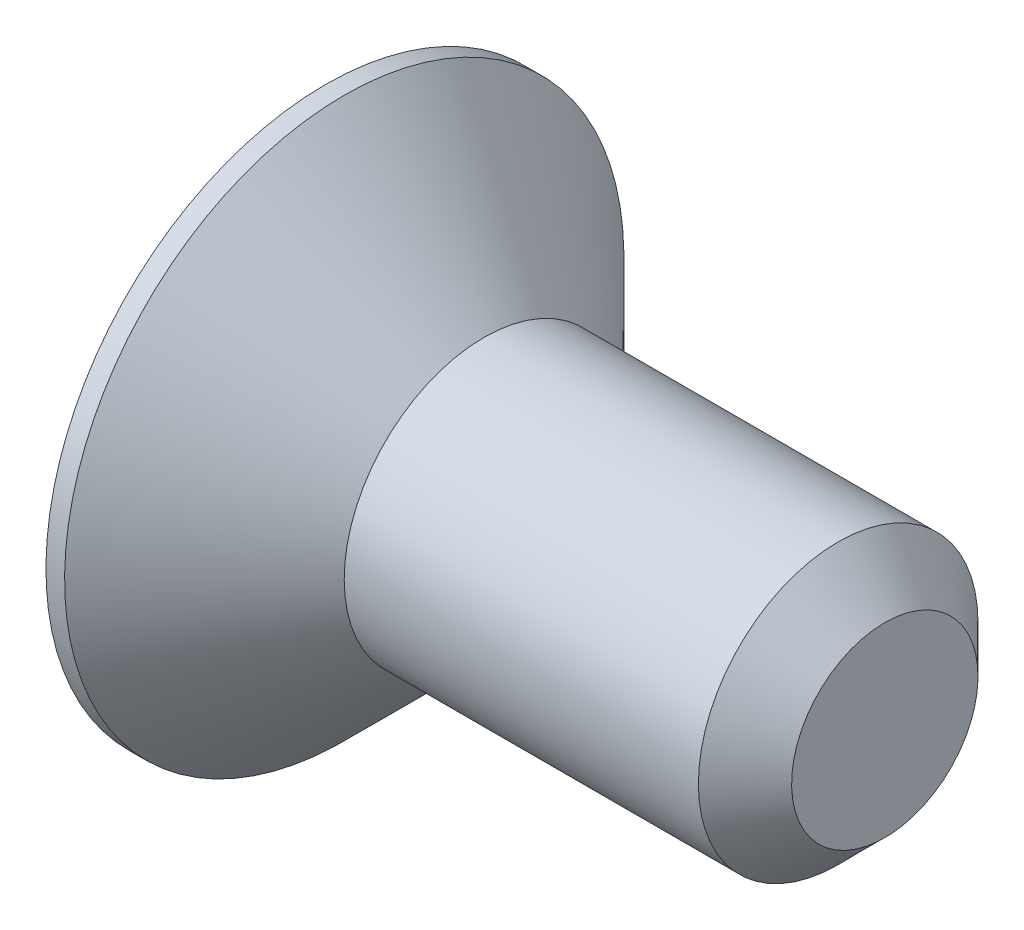
ISO-10303-21;
HEADER;
FILE_DESCRIPTION(('STEP AP214'),'2;1');
FILE_NAME('part.step','',(''),(''),'','','');
FILE_SCHEMA(('AUTOMOTIVE_DESIGN { 1 0 10303 214 1 1 1 1 }'));
ENDSEC;
DATA;
#1=APPLICATION_CONTEXT('core data for automotive mechanical design processes');
#2=APPLICATION_PROTOCOL_DEFINITION('international standard','automotive_design',2000,#1);
#3=PRODUCT_CONTEXT('',#1,'mechanical');
#4=PRODUCT('Part','Part','',(#3));
#5=PRODUCT_RELATED_PRODUCT_CATEGORY('part','',(#4));
#6=PRODUCT_DEFINITION_FORMATION('','',#4);
#7=PRODUCT_DEFINITION_CONTEXT('part definition',#1,'design');
#8=PRODUCT_DEFINITION('design','',#6,#7);
#9=PRODUCT_DEFINITION_SHAPE('','',#8);
#10=(LENGTH_UNIT() NAMED_UNIT(*) SI_UNIT(.MILLI.,.METRE.));
#11=(NAMED_UNIT(*) PLANE_ANGLE_UNIT() SI_UNIT($,.RADIAN.));
#12=(NAMED_UNIT(*) SI_UNIT($,.STERADIAN.) SOLID_ANGLE_UNIT());
#13=UNCERTAINTY_MEASURE_WITH_UNIT(LENGTH_MEASURE(1.E-05),#10,'distance_accuracy_value','');
#14=(GEOMETRIC_REPRESENTATION_CONTEXT(3) GLOBAL_UNCERTAINTY_ASSIGNED_CONTEXT((#13)) GLOBAL_UNIT_ASSIGNED_CONTEXT((#10,
#11,#12)) REPRESENTATION_CONTEXT('',''));
#15=CARTESIAN_POINT('',(0.,0.,0.));
#16=DIRECTION('',(0.,0.,1.));
#17=DIRECTION('',(1.,0.,0.));
#18=AXIS2_PLACEMENT_3D('',#15,#16,#17);
#19=CARTESIAN_POINT('',(0.,0.,0.));
#20=DIRECTION('',(-1.,0.,0.));
#21=DIRECTION('',(0.,-1.,0.));
#22=AXIS2_PLACEMENT_3D('',#19,#20,#21);
#23=PLANE('',#22);
#24=DIRECTION('',(0.,0.5,-0.866025403784438));
#25=VECTOR('',#24,1.);
#26=CARTESIAN_POINT('',(0.,0.577350269189626,1.));
#27=LINE('',#26,#25);
#28=CARTESIAN_POINT('',(0.,0.577350269189626,1.));
#29=VERTEX_POINT('',#28);
#30=CARTESIAN_POINT('',(0.,1.15470053837925,0.));
#31=VERTEX_POINT('',#30);
#32=EDGE_CURVE('E48',#29,#31,#27,.T.);
#33=ORIENTED_EDGE('',*,*,#32,.F.);
#34=DIRECTION('',(0.,1.,0.));
#35=VECTOR('',#34,1.);
#36=CARTESIAN_POINT('',(0.,-0.577350269189626,1.));
#37=LINE('',#36,#35);
#38=CARTESIAN_POINT('',(0.,-0.577350269189626,1.));
#39=VERTEX_POINT('',#38);
#40=EDGE_CURVE('E131',#39,#29,#37,.T.);
#41=ORIENTED_EDGE('',*,*,#40,.F.);
#42=DIRECTION('',(0.,0.5,0.866025403784439));
#43=VECTOR('',#42,1.);
#44=CARTESIAN_POINT('',(0.,-1.15470053837925,0.));
#45=LINE('',#44,#43);
#46=CARTESIAN_POINT('',(0.,-1.15470053837925,0.));
#47=VERTEX_POINT('',#46);
#48=EDGE_CURVE('E129',#47,#39,#45,.T.);
#49=ORIENTED_EDGE('',*,*,#48,.F.);
#50=DIRECTION('',(0.,-0.5,0.866025403784439));
#51=VECTOR('',#50,1.);
#52=CARTESIAN_POINT('',(0.,-0.577350269189625,-1.));
#53=LINE('',#52,#51);
#54=CARTESIAN_POINT('',(0.,-0.577350269189625,-1.));
#55=VERTEX_POINT('',#54);
#56=EDGE_CURVE('E96',#55,#47,#53,.T.);
#57=ORIENTED_EDGE('',*,*,#56,.F.);
#58=DIRECTION('',(0.,-1.,0.));
#59=VECTOR('',#58,1.);
#60=CARTESIAN_POINT('',(0.,0.577350269189626,-1.));
#61=LINE('',#60,#59);
#62=CARTESIAN_POINT('',(0.,0.577350269189626,-1.));
#63=VERTEX_POINT('',#62);
#64=EDGE_CURVE('E125',#63,#55,#61,.T.);
#65=ORIENTED_EDGE('',*,*,#64,.F.);
#66=DIRECTION('',(0.,-0.5,-0.866025403784439));
#67=VECTOR('',#66,1.);
#68=CARTESIAN_POINT('',(0.,1.15470053837925,0.));
#69=LINE('',#68,#67);
#70=EDGE_CURVE('E122',#31,#63,#69,.T.);
#71=ORIENTED_EDGE('',*,*,#70,.F.);
#72=EDGE_LOOP('',(#33,#41,#49,#57,#65,#71));
#73=FACE_BOUND('',#72,.T.);
#74=CARTESIAN_POINT('',(0.,0.,0.));
#75=DIRECTION('',(1.,0.,0.));
#76=DIRECTION('',(0.,1.,0.));
#77=AXIS2_PLACEMENT_3D('',#74,#75,#76);
#78=CIRCLE('',#77,3.);
#79=CARTESIAN_POINT('',(0.,3.,0.));
#80=VERTEX_POINT('',#79);
#81=EDGE_CURVE('E146',#80,#80,#78,.T.);
#82=ORIENTED_EDGE('',*,*,#81,.F.);
#83=EDGE_LOOP('',(#82));
#84=FACE_BOUND('',#83,.T.);
#85=ADVANCED_FACE('F33',(#73,#84),#23,.T.);
#86=CARTESIAN_POINT('',(6.,0.,0.));
#87=DIRECTION('',(1.,0.,0.));
#88=DIRECTION('',(0.,1.,0.));
#89=AXIS2_PLACEMENT_3D('',#86,#87,#88);
#90=CYLINDRICAL_SURFACE('',#89,3.);
#91=ORIENTED_EDGE('',*,*,#81,.T.);
#92=EDGE_LOOP('',(#91));
#93=FACE_BOUND('',#92,.T.);
#94=CARTESIAN_POINT('',(0.199999999999964,0.,0.));
#95=DIRECTION('',(1.,0.,0.));
#96=DIRECTION('',(0.,1.,0.));
#97=AXIS2_PLACEMENT_3D('',#94,#95,#96);
#98=CIRCLE('',#97,3.);
#99=CARTESIAN_POINT('',(0.199999999999964,3.,0.));
#100=VERTEX_POINT('',#99);
#101=EDGE_CURVE('E143',#100,#100,#98,.T.);
#102=ORIENTED_EDGE('',*,*,#101,.F.);
#103=EDGE_LOOP('',(#102));
#104=FACE_BOUND('',#103,.T.);
#105=ADVANCED_FACE('F166',(#93,#104),#90,.T.);
#106=CARTESIAN_POINT('',(1.7,0.,0.));
#107=DIRECTION('',(-1.,0.,0.));
#108=DIRECTION('',(0.,-1.,0.));
#109=AXIS2_PLACEMENT_3D('',#106,#107,#108);
#110=CONICAL_SURFACE('',#109,1.5,0.785398163397437);
#111=ORIENTED_EDGE('',*,*,#101,.T.);
#112=EDGE_LOOP('',(#111));
#113=FACE_BOUND('',#112,.T.);
#114=CARTESIAN_POINT('',(1.7,0.,0.));
#115=DIRECTION('',(1.,0.,0.));
#116=DIRECTION('',(0.,1.,0.));
#117=AXIS2_PLACEMENT_3D('',#114,#115,#116);
#118=CIRCLE('',#117,1.5);
#119=CARTESIAN_POINT('',(1.7,1.5,0.));
#120=VERTEX_POINT('',#119);
#121=EDGE_CURVE('E135',#120,#120,#118,.T.);
#122=ORIENTED_EDGE('',*,*,#121,.F.);
#123=EDGE_LOOP('',(#122));
#124=FACE_BOUND('',#123,.T.);
#125=ADVANCED_FACE('F171',(#113,#124),#110,.T.);
#126=CARTESIAN_POINT('',(6.,0.,0.));
#127=DIRECTION('',(1.,0.,0.));
#128=DIRECTION('',(0.,1.,0.));
#129=AXIS2_PLACEMENT_3D('',#126,#127,#128);
#130=CYLINDRICAL_SURFACE('',#129,1.5);
#131=CARTESIAN_POINT('',(5.5,0.,0.));
#132=DIRECTION('',(1.,0.,0.));
#133=DIRECTION('',(0.,1.,0.));
#134=AXIS2_PLACEMENT_3D('',#131,#132,#133);
#135=CIRCLE('',#134,1.5);
#136=CARTESIAN_POINT('',(5.5,1.5,0.));
#137=VERTEX_POINT('',#136);
#138=EDGE_CURVE('E11',#137,#137,#135,.F.);
#139=ORIENTED_EDGE('',*,*,#138,.T.);
#140=EDGE_LOOP('',(#139));
#141=FACE_BOUND('',#140,.T.);
#142=ORIENTED_EDGE('',*,*,#121,.T.);
#143=EDGE_LOOP('',(#142));
#144=FACE_BOUND('',#143,.T.);
#145=ADVANCED_FACE('F162',(#141,#144),#130,.T.);
#146=CARTESIAN_POINT('',(6.,1.5,0.));
#147=DIRECTION('',(1.,0.,0.));
#148=DIRECTION('',(0.,1.,0.));
#149=AXIS2_PLACEMENT_3D('',#146,#147,#148);
#150=PLANE('',#149);
#151=CARTESIAN_POINT('',(6.,0.,0.));
#152=DIRECTION('',(1.,0.,0.));
#153=DIRECTION('',(0.,1.,0.));
#154=AXIS2_PLACEMENT_3D('',#151,#152,#153);
#155=CIRCLE('',#154,0.999999999999997);
#156=CARTESIAN_POINT('',(6.,0.999999999999998,0.));
#157=VERTEX_POINT('',#156);
#158=EDGE_CURVE('E41',#157,#157,#155,.T.);
#159=ORIENTED_EDGE('',*,*,#158,.T.);
#160=EDGE_LOOP('',(#159));
#161=FACE_BOUND('',#160,.T.);
#162=ADVANCED_FACE('F151',(#161),#150,.T.);
#163=CARTESIAN_POINT('',(6.,0.,0.));
#164=DIRECTION('',(-1.,0.,0.));
#165=DIRECTION('',(0.,-1.,0.));
#166=AXIS2_PLACEMENT_3D('',#163,#164,#165);
#167=CONICAL_SURFACE('',#166,0.999999999999997,0.785398163397449);
#168=ORIENTED_EDGE('',*,*,#138,.F.);
#169=EDGE_LOOP('',(#168));
#170=FACE_BOUND('',#169,.T.);
#171=ORIENTED_EDGE('',*,*,#158,.F.);
#172=EDGE_LOOP('',(#171));
#173=FACE_BOUND('',#172,.T.);
#174=ADVANCED_FACE('F35',(#170,#173),#167,.T.);
#175=CARTESIAN_POINT('',(1.2,0.577350269189626,1.));
#176=DIRECTION('',(0.,0.866025403784439,0.5));
#177=DIRECTION('',(0.,-0.5,0.866025403784439));
#178=AXIS2_PLACEMENT_3D('',#175,#176,#177);
#179=PLANE('',#178);
#180=ORIENTED_EDGE('',*,*,#32,.T.);
#181=DIRECTION('',(-1.,0.,0.));
#182=VECTOR('',#181,1.);
#183=CARTESIAN_POINT('',(1.2,1.15470053837925,0.));
#184=LINE('',#183,#182);
#185=CARTESIAN_POINT('',(1.2,1.15470053837925,0.));
#186=VERTEX_POINT('',#185);
#187=EDGE_CURVE('E78',#186,#31,#184,.T.);
#188=ORIENTED_EDGE('',*,*,#187,.F.);
#189=DIRECTION('',(0.,0.5,-0.866025403784438));
#190=VECTOR('',#189,1.);
#191=CARTESIAN_POINT('',(1.2,0.577350269189626,1.));
#192=LINE('',#191,#190);
#193=CARTESIAN_POINT('',(1.2,0.577350269189626,1.));
#194=VERTEX_POINT('',#193);
#195=EDGE_CURVE('E133',#194,#186,#192,.T.);
#196=ORIENTED_EDGE('',*,*,#195,.F.);
#197=DIRECTION('',(-1.,0.,0.));
#198=VECTOR('',#197,1.);
#199=CARTESIAN_POINT('',(1.2,0.577350269189626,1.));
#200=LINE('',#199,#198);
#201=EDGE_CURVE('E56',#194,#29,#200,.T.);
#202=ORIENTED_EDGE('',*,*,#201,.T.);
#203=EDGE_LOOP('',(#180,#188,#196,#202));
#204=FACE_BOUND('',#203,.T.);
#205=ADVANCED_FACE('F154',(#204),#179,.F.);
#206=CARTESIAN_POINT('',(1.2,-0.577350269189627,1.));
#207=DIRECTION('',(0.,0.,1.));
#208=DIRECTION('',(0.,-1.,0.));
#209=AXIS2_PLACEMENT_3D('',#206,#207,#208);
#210=PLANE('',#209);
#211=ORIENTED_EDGE('',*,*,#40,.T.);
#212=ORIENTED_EDGE('',*,*,#201,.F.);
#213=DIRECTION('',(0.,1.,0.));
#214=VECTOR('',#213,1.);
#215=CARTESIAN_POINT('',(1.2,-0.577350269189627,1.));
#216=LINE('',#215,#214);
#217=CARTESIAN_POINT('',(1.2,-0.577350269189627,1.));
#218=VERTEX_POINT('',#217);
#219=EDGE_CURVE('E108',#218,#194,#216,.T.);
#220=ORIENTED_EDGE('',*,*,#219,.F.);
#221=DIRECTION('',(-1.,0.,0.));
#222=VECTOR('',#221,1.);
#223=CARTESIAN_POINT('',(1.2,-0.577350269189627,1.));
#224=LINE('',#223,#222);
#225=EDGE_CURVE('E100',#218,#39,#224,.T.);
#226=ORIENTED_EDGE('',*,*,#225,.T.);
#227=EDGE_LOOP('',(#211,#212,#220,#226));
#228=FACE_BOUND('',#227,.T.);
#229=ADVANCED_FACE('F160',(#228),#210,.F.);
#230=CARTESIAN_POINT('',(1.2,-1.15470053837925,0.));
#231=DIRECTION('',(0.,-0.866025403784439,0.5));
#232=DIRECTION('',(0.,-0.5,-0.866025403784439));
#233=AXIS2_PLACEMENT_3D('',#230,#231,#232);
#234=PLANE('',#233);
#235=ORIENTED_EDGE('',*,*,#48,.T.);
#236=ORIENTED_EDGE('',*,*,#225,.F.);
#237=DIRECTION('',(0.,0.5,0.866025403784439));
#238=VECTOR('',#237,1.);
#239=CARTESIAN_POINT('',(1.2,-1.15470053837925,0.));
#240=LINE('',#239,#238);
#241=CARTESIAN_POINT('',(1.2,-1.15470053837925,0.));
#242=VERTEX_POINT('',#241);
#243=EDGE_CURVE('E104',#242,#218,#240,.T.);
#244=ORIENTED_EDGE('',*,*,#243,.F.);
#245=DIRECTION('',(-1.,0.,0.));
#246=VECTOR('',#245,1.);
#247=CARTESIAN_POINT('',(1.2,-1.15470053837925,0.));
#248=LINE('',#247,#246);
#249=EDGE_CURVE('E89',#242,#47,#248,.T.);
#250=ORIENTED_EDGE('',*,*,#249,.T.);
#251=EDGE_LOOP('',(#235,#236,#244,#250));
#252=FACE_BOUND('',#251,.T.);
#253=ADVANCED_FACE('F105',(#252),#234,.F.);
#254=CARTESIAN_POINT('',(1.2,-0.577350269189626,-1.));
#255=DIRECTION('',(0.,-0.866025403784439,-0.5));
#256=DIRECTION('',(0.,0.5,-0.866025403784439));
#257=AXIS2_PLACEMENT_3D('',#254,#255,#256);
#258=PLANE('',#257);
#259=ORIENTED_EDGE('',*,*,#56,.T.);
#260=ORIENTED_EDGE('',*,*,#249,.F.);
#261=DIRECTION('',(0.,-0.5,0.866025403784439));
#262=VECTOR('',#261,1.);
#263=CARTESIAN_POINT('',(1.2,-0.577350269189626,-1.));
#264=LINE('',#263,#262);
#265=CARTESIAN_POINT('',(1.2,-0.577350269189626,-1.));
#266=VERTEX_POINT('',#265);
#267=EDGE_CURVE('E93',#266,#242,#264,.T.);
#268=ORIENTED_EDGE('',*,*,#267,.F.);
#269=DIRECTION('',(-1.,0.,0.));
#270=VECTOR('',#269,1.);
#271=CARTESIAN_POINT('',(1.2,-0.577350269189626,-1.));
#272=LINE('',#271,#270);
#273=EDGE_CURVE('E101',#266,#55,#272,.T.);
#274=ORIENTED_EDGE('',*,*,#273,.T.);
#275=EDGE_LOOP('',(#259,#260,#268,#274));
#276=FACE_BOUND('',#275,.T.);
#277=ADVANCED_FACE('F91',(#276),#258,.F.);
#278=CARTESIAN_POINT('',(1.2,0.577350269189626,-1.));
#279=DIRECTION('',(0.,0.,-1.));
#280=DIRECTION('',(-1.,0.,0.));
#281=AXIS2_PLACEMENT_3D('',#278,#279,#280);
#282=PLANE('',#281);
#283=ORIENTED_EDGE('',*,*,#64,.T.);
#284=ORIENTED_EDGE('',*,*,#273,.F.);
#285=DIRECTION('',(0.,-1.,0.));
#286=VECTOR('',#285,1.);
#287=CARTESIAN_POINT('',(1.2,0.577350269189626,-1.));
#288=LINE('',#287,#286);
#289=CARTESIAN_POINT('',(1.2,0.577350269189626,-1.));
#290=VERTEX_POINT('',#289);
#291=EDGE_CURVE('E114',#290,#266,#288,.T.);
#292=ORIENTED_EDGE('',*,*,#291,.F.);
#293=DIRECTION('',(-1.,0.,0.));
#294=VECTOR('',#293,1.);
#295=CARTESIAN_POINT('',(1.2,0.577350269189626,-1.));
#296=LINE('',#295,#294);
#297=EDGE_CURVE('E138',#290,#63,#296,.T.);
#298=ORIENTED_EDGE('',*,*,#297,.T.);
#299=EDGE_LOOP('',(#283,#284,#292,#298));
#300=FACE_BOUND('',#299,.T.);
#301=ADVANCED_FACE('F185',(#300),#282,.F.);
#302=CARTESIAN_POINT('',(1.2,1.15470053837925,0.));
#303=DIRECTION('',(0.,0.866025403784439,-0.5));
#304=DIRECTION('',(0.,0.5,0.866025403784439));
#305=AXIS2_PLACEMENT_3D('',#302,#303,#304);
#306=PLANE('',#305);
#307=ORIENTED_EDGE('',*,*,#70,.T.);
#308=ORIENTED_EDGE('',*,*,#297,.F.);
#309=DIRECTION('',(0.,-0.5,-0.866025403784439));
#310=VECTOR('',#309,1.);
#311=CARTESIAN_POINT('',(1.2,1.15470053837925,0.));
#312=LINE('',#311,#310);
#313=EDGE_CURVE('E116',#186,#290,#312,.T.);
#314=ORIENTED_EDGE('',*,*,#313,.F.);
#315=ORIENTED_EDGE('',*,*,#187,.T.);
#316=EDGE_LOOP('',(#307,#308,#314,#315));
#317=FACE_BOUND('',#316,.T.);
#318=ADVANCED_FACE('F182',(#317),#306,.F.);
#319=CARTESIAN_POINT('',(1.2,0.,0.));
#320=DIRECTION('',(-1.,0.,0.));
#321=DIRECTION('',(0.,-1.,0.));
#322=AXIS2_PLACEMENT_3D('',#319,#320,#321);
#323=PLANE('',#322);
#324=ORIENTED_EDGE('',*,*,#195,.T.);
#325=ORIENTED_EDGE('',*,*,#313,.T.);
#326=ORIENTED_EDGE('',*,*,#291,.T.);
#327=ORIENTED_EDGE('',*,*,#267,.T.);
#328=ORIENTED_EDGE('',*,*,#243,.T.);
#329=ORIENTED_EDGE('',*,*,#219,.T.);
#330=EDGE_LOOP('',(#324,#325,#326,#327,#328,#329));
#331=FACE_BOUND('',#330,.T.);
#332=ADVANCED_FACE('F111',(#331),#323,.T.);
#333=CLOSED_SHELL('',(#85,#105,#125,#145,#162,#174,#205,#229,#253,#277,#301,#318,#332));
#334=MANIFOLD_SOLID_BREP('B2',#333);
#335=ADVANCED_BREP_SHAPE_REPRESENTATION('',(#18,#334),#14);
#336=SHAPE_DEFINITION_REPRESENTATION(#9,#335);
ENDSEC;
END-ISO-10303-21;
